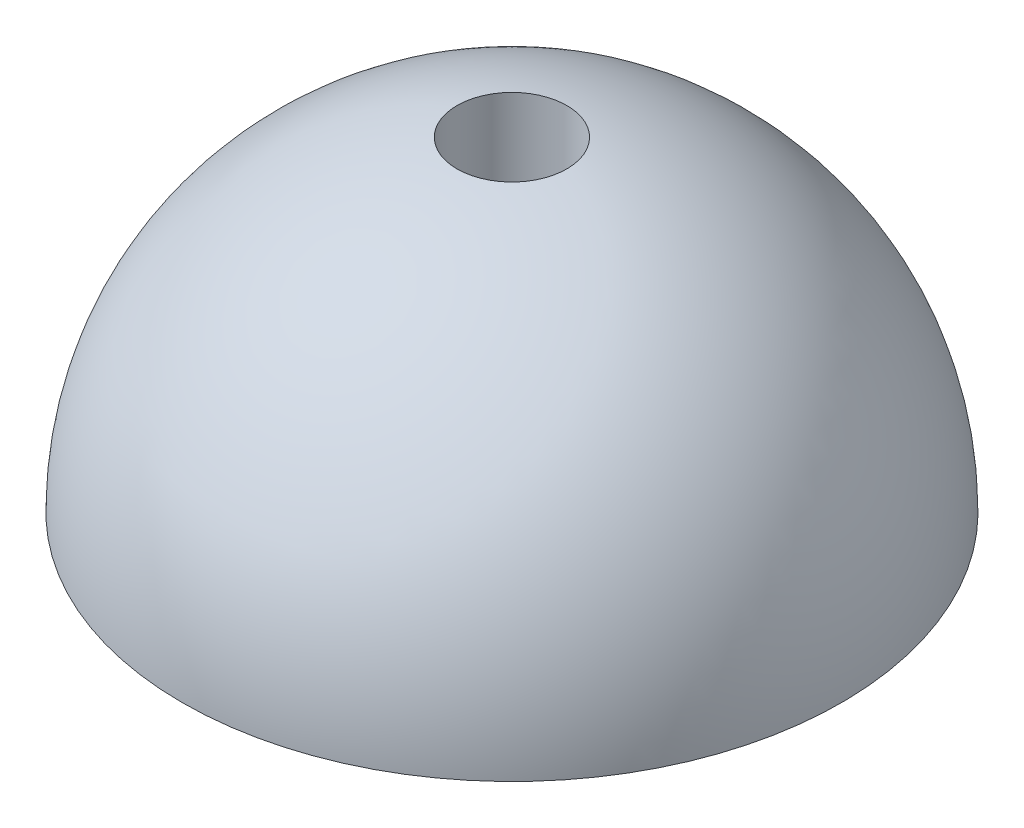
ISO-10303-21;
HEADER;
FILE_DESCRIPTION(('STEP AP214'),'2;1');
FILE_NAME('part.step','',(''),(''),'','','');
FILE_SCHEMA(('AUTOMOTIVE_DESIGN { 1 0 10303 214 1 1 1 1 }'));
ENDSEC;
DATA;
#1=APPLICATION_CONTEXT('core data for automotive mechanical design processes');
#2=APPLICATION_PROTOCOL_DEFINITION('international standard','automotive_design',2000,#1);
#3=PRODUCT_CONTEXT('',#1,'mechanical');
#4=PRODUCT('Part','Part','',(#3));
#5=PRODUCT_RELATED_PRODUCT_CATEGORY('part','',(#4));
#6=PRODUCT_DEFINITION_FORMATION('','',#4);
#7=PRODUCT_DEFINITION_CONTEXT('part definition',#1,'design');
#8=PRODUCT_DEFINITION('design','',#6,#7);
#9=PRODUCT_DEFINITION_SHAPE('','',#8);
#10=(LENGTH_UNIT() NAMED_UNIT(*) SI_UNIT(.MILLI.,.METRE.));
#11=(NAMED_UNIT(*) PLANE_ANGLE_UNIT() SI_UNIT($,.RADIAN.));
#12=(NAMED_UNIT(*) SI_UNIT($,.STERADIAN.) SOLID_ANGLE_UNIT());
#13=UNCERTAINTY_MEASURE_WITH_UNIT(LENGTH_MEASURE(1.E-05),#10,'distance_accuracy_value','');
#14=(GEOMETRIC_REPRESENTATION_CONTEXT(3) GLOBAL_UNCERTAINTY_ASSIGNED_CONTEXT((#13)) GLOBAL_UNIT_ASSIGNED_CONTEXT((#10,
#11,#12)) REPRESENTATION_CONTEXT('',''));
#15=CARTESIAN_POINT('',(0.,0.,0.));
#16=DIRECTION('',(0.,0.,1.));
#17=DIRECTION('',(1.,0.,0.));
#18=AXIS2_PLACEMENT_3D('',#15,#16,#17);
#19=CARTESIAN_POINT('',(0.,0.,0.));
#20=DIRECTION('',(0.,1.,0.));
#21=DIRECTION('',(0.,0.,1.));
#22=AXIS2_PLACEMENT_3D('',#19,#20,#21);
#23=CYLINDRICAL_SURFACE('',#22,5.);
#24=CARTESIAN_POINT('',(0.,0.,0.));
#25=DIRECTION('',(0.,1.,0.));
#26=DIRECTION('',(0.,0.,1.));
#27=AXIS2_PLACEMENT_3D('',#24,#25,#26);
#28=CIRCLE('',#27,5.);
#29=CARTESIAN_POINT('',(0.,0.,5.));
#30=VERTEX_POINT('',#29);
#31=EDGE_CURVE('E10',#30,#30,#28,.T.);
#32=ORIENTED_EDGE('',*,*,#31,.F.);
#33=EDGE_LOOP('',(#32));
#34=FACE_BOUND('',#33,.T.);
#35=CARTESIAN_POINT('',(0.,29.5803989154981,0.));
#36=DIRECTION('',(0.,1.,0.));
#37=DIRECTION('',(0.,0.,1.));
#38=AXIS2_PLACEMENT_3D('',#35,#36,#37);
#39=CIRCLE('',#38,5.);
#40=CARTESIAN_POINT('',(0.,29.5803989154981,5.));
#41=VERTEX_POINT('',#40);
#42=EDGE_CURVE('E44',#41,#41,#39,.T.);
#43=ORIENTED_EDGE('',*,*,#42,.T.);
#44=EDGE_LOOP('',(#43));
#45=FACE_BOUND('',#44,.T.);
#46=ADVANCED_FACE('F34',(#34,#45),#23,.F.);
#47=CARTESIAN_POINT('',(5.,0.,0.));
#48=DIRECTION('',(0.,1.,0.));
#49=DIRECTION('',(0.,0.,1.));
#50=AXIS2_PLACEMENT_3D('',#47,#48,#49);
#51=PLANE('',#50);
#52=CARTESIAN_POINT('',(0.,0.,0.));
#53=DIRECTION('',(0.,1.,0.));
#54=DIRECTION('',(0.,0.,1.));
#55=AXIS2_PLACEMENT_3D('',#52,#53,#54);
#56=CIRCLE('',#55,30.);
#57=CARTESIAN_POINT('',(0.,0.,30.));
#58=VERTEX_POINT('',#57);
#59=EDGE_CURVE('E40',#58,#58,#56,.T.);
#60=ORIENTED_EDGE('',*,*,#59,.F.);
#61=EDGE_LOOP('',(#60));
#62=FACE_BOUND('',#61,.T.);
#63=ORIENTED_EDGE('',*,*,#31,.T.);
#64=EDGE_LOOP('',(#63));
#65=FACE_BOUND('',#64,.T.);
#66=ADVANCED_FACE('F54',(#62,#65),#51,.F.);
#67=CARTESIAN_POINT('',(0.,0.,0.));
#68=DIRECTION('',(0.,1.,0.));
#69=DIRECTION('',(1.,0.,0.));
#70=AXIS2_PLACEMENT_3D('',#67,#68,#69);
#71=SPHERICAL_SURFACE('',#70,30.);
#72=ORIENTED_EDGE('',*,*,#42,.F.);
#73=EDGE_LOOP('',(#72));
#74=FACE_BOUND('',#73,.T.);
#75=ORIENTED_EDGE('',*,*,#59,.T.);
#76=EDGE_LOOP('',(#75));
#77=FACE_BOUND('',#76,.T.);
#78=ADVANCED_FACE('F52',(#74,#77),#71,.T.);
#79=CLOSED_SHELL('',(#46,#66,#78));
#80=MANIFOLD_SOLID_BREP('B2',#79);
#81=ADVANCED_BREP_SHAPE_REPRESENTATION('',(#18,#80),#14);
#82=SHAPE_DEFINITION_REPRESENTATION(#9,#81);
ENDSEC;
END-ISO-10303-21;
